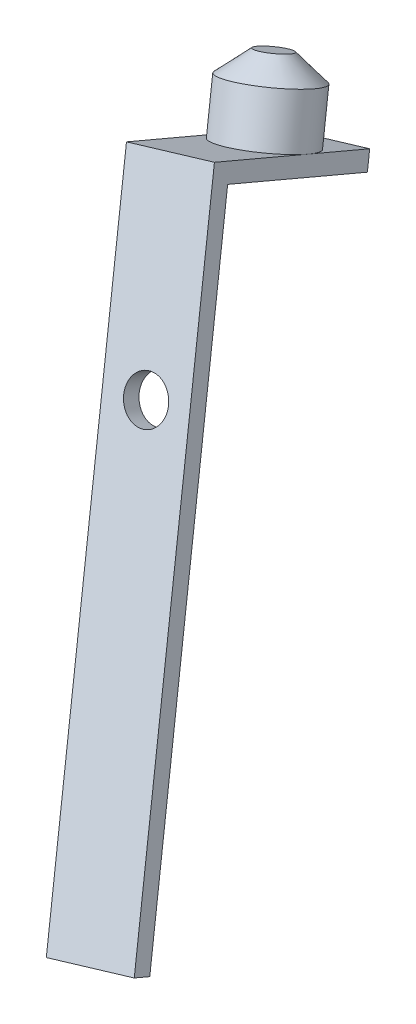
ISO-10303-21;
HEADER;
FILE_DESCRIPTION(('STEP AP214'),'2;1');
FILE_NAME('part.step','',(''),(''),'','','');
FILE_SCHEMA(('AUTOMOTIVE_DESIGN { 1 0 10303 214 1 1 1 1 }'));
ENDSEC;
DATA;
#1=APPLICATION_CONTEXT('core data for automotive mechanical design processes');
#2=APPLICATION_PROTOCOL_DEFINITION('international standard','automotive_design',2000,#1);
#3=PRODUCT_CONTEXT('',#1,'mechanical');
#4=PRODUCT('Part','Part','',(#3));
#5=PRODUCT_RELATED_PRODUCT_CATEGORY('part','',(#4));
#6=PRODUCT_DEFINITION_FORMATION('','',#4);
#7=PRODUCT_DEFINITION_CONTEXT('part definition',#1,'design');
#8=PRODUCT_DEFINITION('design','',#6,#7);
#9=PRODUCT_DEFINITION_SHAPE('','',#8);
#10=(LENGTH_UNIT() NAMED_UNIT(*) SI_UNIT(.MILLI.,.METRE.));
#11=(NAMED_UNIT(*) PLANE_ANGLE_UNIT() SI_UNIT($,.RADIAN.));
#12=(NAMED_UNIT(*) SI_UNIT($,.STERADIAN.) SOLID_ANGLE_UNIT());
#13=UNCERTAINTY_MEASURE_WITH_UNIT(LENGTH_MEASURE(1.E-05),#10,'distance_accuracy_value','');
#14=(GEOMETRIC_REPRESENTATION_CONTEXT(3) GLOBAL_UNCERTAINTY_ASSIGNED_CONTEXT((#13)) GLOBAL_UNIT_ASSIGNED_CONTEXT((#10,
#11,#12)) REPRESENTATION_CONTEXT('',''));
#15=CARTESIAN_POINT('',(0.,0.,0.));
#16=DIRECTION('',(0.,0.,1.));
#17=DIRECTION('',(1.,0.,0.));
#18=AXIS2_PLACEMENT_3D('',#15,#16,#17);
#19=CARTESIAN_POINT('',(-9.87720756884579,-10.4522564494439,322.697255318714));
#20=DIRECTION('',(0.242446875001236,-0.893041299663537,0.379073541542265));
#21=DIRECTION('',(0.,-0.390731128489272,-0.920504853452441));
#22=AXIS2_PLACEMENT_3D('',#19,#20,#21);
#23=PLANE('',#22);
#24=CARTESIAN_POINT('',(-5.12733587041595,-14.0893165058083,311.090968127761));
#25=DIRECTION('',(0.242446875001236,-0.893041299663537,0.379073541542265));
#26=DIRECTION('',(0.,-0.390731128489272,-0.920504853452441));
#27=AXIS2_PLACEMENT_3D('',#24,#25,#26);
#28=CIRCLE('',#27,4.89594372995816);
#29=CARTESIAN_POINT('',(-9.87720756884608,-15.1819615269251,311.554768422282));
#30=VERTEX_POINT('',#29);
#31=CARTESIAN_POINT('',(-0.377464171985477,-12.9966714846916,310.62716783324));
#32=VERTEX_POINT('',#31);
#33=EDGE_CURVE('E128',#30,#32,#28,.F.);
#34=ORIENTED_EDGE('',*,*,#33,.F.);
#35=DIRECTION('',(0.,-0.390731128489272,-0.920504853452441));
#36=VECTOR('',#35,1.);
#37=CARTESIAN_POINT('',(-9.87720756884579,-10.4522564494439,322.697255318714));
#38=LINE('',#37,#36);
#39=CARTESIAN_POINT('',(-9.87720756884579,-10.4522564494439,322.697255318714));
#40=VERTEX_POINT('',#39);
#41=EDGE_CURVE('E111',#40,#30,#38,.T.);
#42=ORIENTED_EDGE('',*,*,#41,.F.);
#43=DIRECTION('',(-0.970164683340996,-0.223173525143017,0.0947315410679266));
#44=VECTOR('',#43,1.);
#45=CARTESIAN_POINT('',(-9.87720756884579,-10.4522564494439,322.697255318714));
#46=LINE('',#45,#44);
#47=CARTESIAN_POINT('',(-0.377464171985523,-8.26696640721067,321.769654729672));
#48=VERTEX_POINT('',#47);
#49=EDGE_CURVE('E68',#48,#40,#46,.T.);
#50=ORIENTED_EDGE('',*,*,#49,.F.);
#51=DIRECTION('',(0.,-0.390731128489272,-0.920504853452441));
#52=VECTOR('',#51,1.);
#53=CARTESIAN_POINT('',(-0.377464171985523,-8.26696640721067,321.769654729672));
#54=LINE('',#53,#52);
#55=EDGE_CURVE('E130',#48,#32,#54,.T.);
#56=ORIENTED_EDGE('',*,*,#55,.T.);
#57=EDGE_LOOP('',(#34,#42,#50,#56));
#58=FACE_BOUND('',#57,.T.);
#59=ADVANCED_FACE('F43',(#58),#23,.F.);
#60=CARTESIAN_POINT('',(-1.53843465905612E-12,113.687272840091,267.830430684381));
#61=DIRECTION('',(0.,0.390731128489272,0.920504853452441));
#62=DIRECTION('',(0.,-0.920504853452441,0.390731128489272));
#63=AXIS2_PLACEMENT_3D('',#60,#61,#62);
#64=PLANE('',#63);
#65=CARTESIAN_POINT('',(-1.74575689842299E-13,-29.0273665670101,328.40920101713));
#66=DIRECTION('',(0.,0.390731128489272,0.920504853452441));
#67=DIRECTION('',(0.,-0.920504853452441,0.390731128489272));
#68=AXIS2_PLACEMENT_3D('',#65,#66,#67);
#69=CIRCLE('',#68,2.49999999999998);
#70=CARTESIAN_POINT('',(-1.74575689842299E-13,-31.3286287006412,329.386028838353));
#71=VERTEX_POINT('',#70);
#72=EDGE_CURVE('E151',#71,#71,#69,.T.);
#73=ORIENTED_EDGE('',*,*,#72,.T.);
#74=EDGE_LOOP('',(#73));
#75=FACE_BOUND('',#74,.T.);
#76=DIRECTION('',(-0.970164683340996,-0.223173525143017,0.0947315410679266));
#77=VECTOR('',#76,1.);
#78=CARTESIAN_POINT('',(-9.39231381884332,-13.0198013057495,321.614392694893));
#79=LINE('',#78,#77);
#80=CARTESIAN_POINT('',(0.107429578016946,-10.8345112635163,320.686792105852));
#81=VERTEX_POINT('',#80);
#82=CARTESIAN_POINT('',(-9.39231381884332,-13.0198013057495,321.614392694893));
#83=VERTEX_POINT('',#82);
#84=EDGE_CURVE('E135',#81,#83,#79,.T.);
#85=ORIENTED_EDGE('',*,*,#84,.F.);
#86=DIRECTION('',(-0.242446875001238,0.893041299663537,-0.379073541542265));
#87=VECTOR('',#86,1.);
#88=CARTESIAN_POINT('',(16.4923000593206,-71.1873866279333,346.305067783884));
#89=LINE('',#88,#87);
#90=CARTESIAN_POINT('',(16.4923000593206,-71.1873866279333,346.305067783884));
#91=VERTEX_POINT('',#90);
#92=EDGE_CURVE('E159',#91,#81,#89,.T.);
#93=ORIENTED_EDGE('',*,*,#92,.F.);
#94=DIRECTION('',(0.970164683340995,0.223173525143019,-0.0947315410679266));
#95=VECTOR('',#94,1.);
#96=CARTESIAN_POINT('',(6.99255666246035,-73.3726766701665,347.232668372925));
#97=LINE('',#96,#95);
#98=CARTESIAN_POINT('',(6.99255666246035,-73.3726766701665,347.232668372925));
#99=VERTEX_POINT('',#98);
#100=EDGE_CURVE('E84',#99,#91,#97,.T.);
#101=ORIENTED_EDGE('',*,*,#100,.F.);
#102=DIRECTION('',(0.242446875001238,-0.893041299663537,0.379073541542265));
#103=VECTOR('',#102,1.);
#104=CARTESIAN_POINT('',(-9.87720756884578,-11.2337187064224,320.856245611809));
#105=LINE('',#104,#103);
#106=EDGE_CURVE('E155',#83,#99,#105,.T.);
#107=ORIENTED_EDGE('',*,*,#106,.F.);
#108=EDGE_LOOP('',(#85,#93,#101,#107));
#109=FACE_BOUND('',#108,.T.);
#110=ADVANCED_FACE('F185',(#75,#109),#64,.F.);
#111=CARTESIAN_POINT('',(-1.5454176217338E-12,114.46873509707,269.671440391286));
#112=DIRECTION('',(0.,0.390731128489272,0.920504853452441));
#113=DIRECTION('',(0.,-0.920504853452441,0.390731128489272));
#114=AXIS2_PLACEMENT_3D('',#111,#112,#113);
#115=PLANE('',#114);
#116=DIRECTION('',(0.242446875001238,-0.893041299663537,0.379073541542265));
#117=VECTOR('',#116,1.);
#118=CARTESIAN_POINT('',(-9.87720756884579,-10.4522564494439,322.697255318714));
#119=LINE('',#118,#117);
#120=CARTESIAN_POINT('',(6.99255666246034,-72.591214413188,349.07367807983));
#121=VERTEX_POINT('',#120);
#122=EDGE_CURVE('E117',#40,#121,#119,.T.);
#123=ORIENTED_EDGE('',*,*,#122,.T.);
#124=DIRECTION('',(0.970164683340995,0.223173525143019,-0.0947315410679266));
#125=VECTOR('',#124,1.);
#126=CARTESIAN_POINT('',(6.99255666246034,-72.591214413188,349.07367807983));
#127=LINE('',#126,#125);
#128=CARTESIAN_POINT('',(16.4923000593206,-70.4059243709548,348.146077490789));
#129=VERTEX_POINT('',#128);
#130=EDGE_CURVE('E89',#121,#129,#127,.T.);
#131=ORIENTED_EDGE('',*,*,#130,.T.);
#132=DIRECTION('',(-0.242446875001238,0.893041299663537,-0.379073541542265));
#133=VECTOR('',#132,1.);
#134=CARTESIAN_POINT('',(16.4923000593206,-70.4059243709548,348.146077490789));
#135=LINE('',#134,#133);
#136=EDGE_CURVE('E161',#129,#48,#135,.T.);
#137=ORIENTED_EDGE('',*,*,#136,.T.);
#138=ORIENTED_EDGE('',*,*,#49,.T.);
#139=EDGE_LOOP('',(#123,#131,#137,#138));
#140=FACE_BOUND('',#139,.T.);
#141=CARTESIAN_POINT('',(-1.81558652519985E-13,-28.2459043100315,330.250210724035));
#142=DIRECTION('',(0.,0.390731128489272,0.920504853452441));
#143=DIRECTION('',(0.,-0.920504853452441,0.390731128489272));
#144=AXIS2_PLACEMENT_3D('',#141,#142,#143);
#145=CIRCLE('',#144,2.49999999999998);
#146=CARTESIAN_POINT('',(-1.81558652519985E-13,-30.5471664436626,331.227038545258));
#147=VERTEX_POINT('',#146);
#148=EDGE_CURVE('E152',#147,#147,#145,.T.);
#149=ORIENTED_EDGE('',*,*,#148,.F.);
#150=EDGE_LOOP('',(#149));
#151=FACE_BOUND('',#150,.T.);
#152=ADVANCED_FACE('F191',(#140,#151),#115,.T.);
#153=CARTESIAN_POINT('',(-9.87720756884579,-10.4522564494439,322.697255318714));
#154=DIRECTION('',(0.970164683340995,0.223173525143018,-0.094731541067928));
#155=DIRECTION('',(-0.224181702674668,0.974547363746825,0.));
#156=AXIS2_PLACEMENT_3D('',#153,#154,#155);
#157=PLANE('',#156);
#158=ORIENTED_EDGE('',*,*,#41,.T.);
#159=CARTESIAN_POINT('',(-9.87720756884573,-18.2668790192293,304.287158249665));
#160=VERTEX_POINT('',#159);
#161=EDGE_CURVE('E114',#30,#160,#38,.T.);
#162=ORIENTED_EDGE('',*,*,#161,.T.);
#163=DIRECTION('',(-0.242446875001226,0.893041299663533,-0.379073541542281));
#164=VECTOR('',#163,1.);
#165=CARTESIAN_POINT('',(-9.87720756884573,-18.2668790192293,304.287158249665));
#166=LINE('',#165,#164);
#167=CARTESIAN_POINT('',(-9.39231381884326,-20.0529616185564,305.045305332749));
#168=VERTEX_POINT('',#167);
#169=EDGE_CURVE('E137',#168,#160,#166,.T.);
#170=ORIENTED_EDGE('',*,*,#169,.F.);
#171=DIRECTION('',(0.,0.390731128489272,0.920504853452441));
#172=VECTOR('',#171,1.);
#173=CARTESIAN_POINT('',(-9.39231381884326,-20.0529616185564,305.045305332749));
#174=LINE('',#173,#172);
#175=EDGE_CURVE('E145',#168,#83,#174,.T.);
#176=ORIENTED_EDGE('',*,*,#175,.T.);
#177=ORIENTED_EDGE('',*,*,#106,.T.);
#178=DIRECTION('',(0.,-0.390731128489272,-0.920504853452441));
#179=VECTOR('',#178,1.);
#180=CARTESIAN_POINT('',(6.99255666246034,-72.591214413188,349.07367807983));
#181=LINE('',#180,#179);
#182=EDGE_CURVE('E132',#121,#99,#181,.T.);
#183=ORIENTED_EDGE('',*,*,#182,.F.);
#184=ORIENTED_EDGE('',*,*,#122,.F.);
#185=EDGE_LOOP('',(#158,#162,#170,#176,#177,#183,#184));
#186=FACE_BOUND('',#185,.T.);
#187=ADVANCED_FACE('F112',(#186),#157,.F.);
#188=CARTESIAN_POINT('',(6.99255666246034,-72.591214413188,349.07367807983));
#189=DIRECTION('',(-0.242446875001239,0.893041299663537,-0.379073541542265));
#190=DIRECTION('',(0.,0.390731128489272,0.920504853452441));
#191=AXIS2_PLACEMENT_3D('',#188,#189,#190);
#192=PLANE('',#191);
#193=ORIENTED_EDGE('',*,*,#100,.T.);
#194=DIRECTION('',(0.,-0.390731128489272,-0.920504853452441));
#195=VECTOR('',#194,1.);
#196=CARTESIAN_POINT('',(16.4923000593206,-70.4059243709548,348.146077490789));
#197=LINE('',#196,#195);
#198=EDGE_CURVE('E169',#129,#91,#197,.T.);
#199=ORIENTED_EDGE('',*,*,#198,.F.);
#200=ORIENTED_EDGE('',*,*,#130,.F.);
#201=ORIENTED_EDGE('',*,*,#182,.T.);
#202=EDGE_LOOP('',(#193,#199,#200,#201));
#203=FACE_BOUND('',#202,.T.);
#204=ADVANCED_FACE('F206',(#203),#192,.F.);
#205=CARTESIAN_POINT('',(16.4923000593206,-70.4059243709548,348.146077490789));
#206=DIRECTION('',(-0.970164683340996,-0.223173525143018,0.094731541067928));
#207=DIRECTION('',(0.224181702674668,-0.974547363746825,0.));
#208=AXIS2_PLACEMENT_3D('',#205,#206,#207);
#209=PLANE('',#208);
#210=ORIENTED_EDGE('',*,*,#92,.T.);
#211=DIRECTION('',(0.,0.390731128489272,0.920504853452441));
#212=VECTOR('',#211,1.);
#213=CARTESIAN_POINT('',(0.107429578017,-17.8676715763232,304.117704743708));
#214=LINE('',#213,#212);
#215=CARTESIAN_POINT('',(0.107429578017,-17.8676715763232,304.117704743708));
#216=VERTEX_POINT('',#215);
#217=EDGE_CURVE('E149',#216,#81,#214,.T.);
#218=ORIENTED_EDGE('',*,*,#217,.F.);
#219=DIRECTION('',(0.242446875001225,-0.893041299663533,0.379073541542281));
#220=VECTOR('',#219,1.);
#221=CARTESIAN_POINT('',(-0.377464171985462,-16.0815889769961,303.359557660623));
#222=LINE('',#221,#220);
#223=CARTESIAN_POINT('',(-0.377464171985462,-16.0815889769961,303.359557660623));
#224=VERTEX_POINT('',#223);
#225=EDGE_CURVE('E142',#224,#216,#222,.T.);
#226=ORIENTED_EDGE('',*,*,#225,.F.);
#227=EDGE_CURVE('E120',#32,#224,#54,.T.);
#228=ORIENTED_EDGE('',*,*,#227,.F.);
#229=ORIENTED_EDGE('',*,*,#55,.F.);
#230=ORIENTED_EDGE('',*,*,#136,.F.);
#231=ORIENTED_EDGE('',*,*,#198,.T.);
#232=EDGE_LOOP('',(#210,#218,#226,#228,#229,#230,#231));
#233=FACE_BOUND('',#232,.T.);
#234=ADVANCED_FACE('F197',(#233),#209,.F.);
#235=CARTESIAN_POINT('',(-5.12733587041589,-14.0893165058085,311.090968127761));
#236=DIRECTION('',(-0.242446875001238,0.893041299663537,-0.379073541542265));
#237=DIRECTION('',(0.,0.390731128489272,0.920504853452441));
#238=AXIS2_PLACEMENT_3D('',#235,#236,#237);
#239=CIRCLE('',#238,4.89594372995816);
#240=EDGE_CURVE('E59',#32,#30,#239,.T.);
#241=ORIENTED_EDGE('',*,*,#240,.F.);
#242=ORIENTED_EDGE('',*,*,#227,.T.);
#243=DIRECTION('',(0.970164683340996,0.223173525143017,-0.0947315410679266));
#244=VECTOR('',#243,1.);
#245=CARTESIAN_POINT('',(-9.87720756884573,-18.2668790192293,304.287158249665));
#246=LINE('',#245,#244);
#247=EDGE_CURVE('E124',#160,#224,#246,.T.);
#248=ORIENTED_EDGE('',*,*,#247,.F.);
#249=ORIENTED_EDGE('',*,*,#161,.F.);
#250=EDGE_LOOP('',(#241,#242,#248,#249));
#251=FACE_BOUND('',#250,.T.);
#252=ADVANCED_FACE('F122',(#251),#23,.F.);
#253=CARTESIAN_POINT('',(-1.81558652519985E-13,-28.2459043100315,330.250210724035));
#254=DIRECTION('',(0.,-0.390731128489272,-0.920504853452441));
#255=DIRECTION('',(0.,0.920504853452441,-0.390731128489272));
#256=AXIS2_PLACEMENT_3D('',#253,#254,#255);
#257=CYLINDRICAL_SURFACE('',#256,2.49999999999998);
#258=ORIENTED_EDGE('',*,*,#148,.T.);
#259=EDGE_LOOP('',(#258));
#260=FACE_BOUND('',#259,.T.);
#261=ORIENTED_EDGE('',*,*,#72,.F.);
#262=EDGE_LOOP('',(#261));
#263=FACE_BOUND('',#262,.T.);
#264=ADVANCED_FACE('F196',(#260,#263),#257,.F.);
#265=CARTESIAN_POINT('',(-9.39231381884326,-20.0529616185564,305.045305332749));
#266=DIRECTION('',(-0.242446875001236,0.893041299663537,-0.379073541542265));
#267=DIRECTION('',(0.,0.390731128489272,0.920504853452441));
#268=AXIS2_PLACEMENT_3D('',#265,#266,#267);
#269=PLANE('',#268);
#270=ORIENTED_EDGE('',*,*,#84,.T.);
#271=ORIENTED_EDGE('',*,*,#175,.F.);
#272=DIRECTION('',(-0.970164683340996,-0.223173525143017,0.0947315410679266));
#273=VECTOR('',#272,1.);
#274=CARTESIAN_POINT('',(-9.39231381884326,-20.0529616185564,305.045305332749));
#275=LINE('',#274,#273);
#276=EDGE_CURVE('E144',#216,#168,#275,.T.);
#277=ORIENTED_EDGE('',*,*,#276,.F.);
#278=ORIENTED_EDGE('',*,*,#217,.T.);
#279=EDGE_LOOP('',(#270,#271,#277,#278));
#280=FACE_BOUND('',#279,.T.);
#281=ADVANCED_FACE('F202',(#280),#269,.F.);
#282=CARTESIAN_POINT('',(-2.32410835868106E-12,106.654112527288,251.261343322233));
#283=DIRECTION('',(0.,0.390731128489286,0.920504853452435));
#284=DIRECTION('',(0.,-0.920504853452435,0.390731128489286));
#285=AXIS2_PLACEMENT_3D('',#282,#283,#284);
#286=PLANE('',#285);
#287=ORIENTED_EDGE('',*,*,#169,.T.);
#288=ORIENTED_EDGE('',*,*,#247,.T.);
#289=ORIENTED_EDGE('',*,*,#225,.T.);
#290=ORIENTED_EDGE('',*,*,#276,.T.);
#291=EDGE_LOOP('',(#287,#288,#289,#290));
#292=FACE_BOUND('',#291,.T.);
#293=ADVANCED_FACE('F226',(#292),#286,.F.);
#294=CARTESIAN_POINT('',(-7.06691087042579,-6.94498610850024,308.058379795423));
#295=DIRECTION('',(0.242446875001238,-0.893041299663537,0.379073541542265));
#296=DIRECTION('',(0.,-0.390731128489272,-0.920504853452441));
#297=AXIS2_PLACEMENT_3D('',#294,#295,#296);
#298=CYLINDRICAL_SURFACE('',#297,4.89594372995816);
#299=CARTESIAN_POINT('',(-6.47900531153917,-9.11050770734471,308.97758917809));
#300=DIRECTION('',(-0.242446875001238,0.893041299663537,-0.379073541542265));
#301=DIRECTION('',(0.,0.390731128489272,0.920504853452441));
#302=AXIS2_PLACEMENT_3D('',#299,#300,#301);
#303=CIRCLE('',#302,4.89594372995816);
#304=CARTESIAN_POINT('',(-6.47900531153917,-7.19751008871818,313.484329143747));
#305=VERTEX_POINT('',#304);
#306=EDGE_CURVE('E11',#305,#305,#303,.F.);
#307=ORIENTED_EDGE('',*,*,#306,.T.);
#308=EDGE_LOOP('',(#307));
#309=FACE_BOUND('',#308,.T.);
#310=ORIENTED_EDGE('',*,*,#240,.T.);
#311=ORIENTED_EDGE('',*,*,#33,.T.);
#312=EDGE_LOOP('',(#310,#311));
#313=FACE_BOUND('',#312,.T.);
#314=ADVANCED_FACE('F134',(#309,#313),#298,.T.);
#315=CARTESIAN_POINT('',(-7.06691087042579,-6.94498610850024,308.058379795423));
#316=DIRECTION('',(-0.242446875001238,0.893041299663537,-0.379073541542265));
#317=DIRECTION('',(0.,0.390731128489272,0.920504853452441));
#318=AXIS2_PLACEMENT_3D('',#315,#316,#317);
#319=PLANE('',#318);
#320=CARTESIAN_POINT('',(-7.06691087042579,-6.94498610850024,308.058379795423));
#321=DIRECTION('',(-0.242446875001238,0.893041299663537,-0.379073541542265));
#322=DIRECTION('',(0.,0.390731128489272,0.920504853452441));
#323=AXIS2_PLACEMENT_3D('',#320,#321,#322);
#324=CIRCLE('',#323,1.86594372995816);
#325=CARTESIAN_POINT('',(-7.06691087042579,-6.21590380919621,309.775990055118));
#326=VERTEX_POINT('',#325);
#327=EDGE_CURVE('E52',#326,#326,#324,.T.);
#328=ORIENTED_EDGE('',*,*,#327,.T.);
#329=EDGE_LOOP('',(#328));
#330=FACE_BOUND('',#329,.T.);
#331=ADVANCED_FACE('F174',(#330),#319,.T.);
#332=CARTESIAN_POINT('',(-7.06691087042579,-6.94498610850024,308.058379795423));
#333=DIRECTION('',(0.242446875001238,-0.893041299663537,0.379073541542265));
#334=DIRECTION('',(0.,-0.390731128489272,-0.920504853452441));
#335=AXIS2_PLACEMENT_3D('',#332,#333,#334);
#336=CONICAL_SURFACE('',#335,1.86594372995816,0.895877505048691);
#337=ORIENTED_EDGE('',*,*,#306,.F.);
#338=EDGE_LOOP('',(#337));
#339=FACE_BOUND('',#338,.T.);
#340=ORIENTED_EDGE('',*,*,#327,.F.);
#341=EDGE_LOOP('',(#340));
#342=FACE_BOUND('',#341,.T.);
#343=ADVANCED_FACE('F46',(#339,#342),#336,.T.);
#344=CLOSED_SHELL('',(#59,#110,#152,#187,#204,#234,#252,#264,#281,#293,#314,#331,#343));
#345=MANIFOLD_SOLID_BREP('B2',#344);
#346=ADVANCED_BREP_SHAPE_REPRESENTATION('',(#18,#345),#14);
#347=SHAPE_DEFINITION_REPRESENTATION(#9,#346);
ENDSEC;
END-ISO-10303-21;
